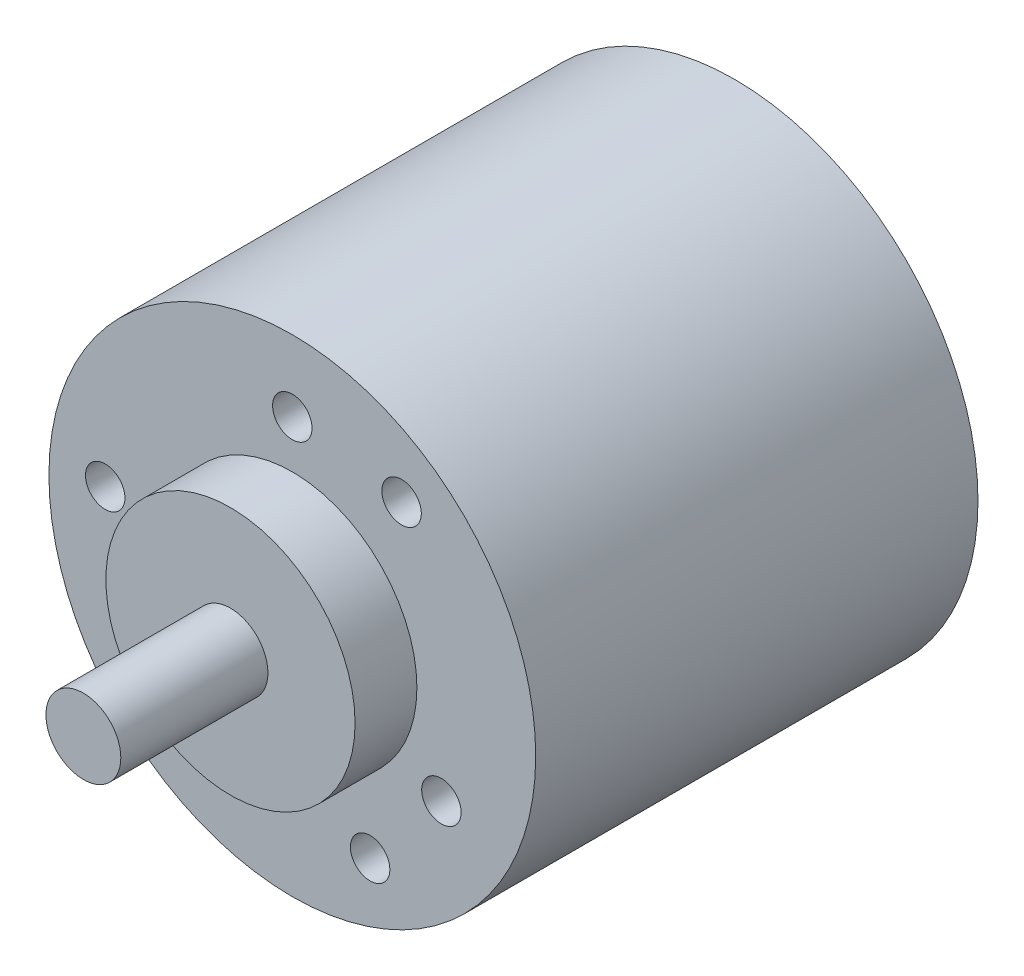
ISO-10303-21;
HEADER;
FILE_DESCRIPTION(('STEP AP214'),'2;1');
FILE_NAME('part.step','',(''),(''),'','','');
FILE_SCHEMA(('AUTOMOTIVE_DESIGN { 1 0 10303 214 1 1 1 1 }'));
ENDSEC;
DATA;
#1=APPLICATION_CONTEXT('core data for automotive mechanical design processes');
#2=APPLICATION_PROTOCOL_DEFINITION('international standard','automotive_design',2000,#1);
#3=PRODUCT_CONTEXT('',#1,'mechanical');
#4=PRODUCT('Part','Part','',(#3));
#5=PRODUCT_RELATED_PRODUCT_CATEGORY('part','',(#4));
#6=PRODUCT_DEFINITION_FORMATION('','',#4);
#7=PRODUCT_DEFINITION_CONTEXT('part definition',#1,'design');
#8=PRODUCT_DEFINITION('design','',#6,#7);
#9=PRODUCT_DEFINITION_SHAPE('','',#8);
#10=(LENGTH_UNIT() NAMED_UNIT(*) SI_UNIT(.MILLI.,.METRE.));
#11=(NAMED_UNIT(*) PLANE_ANGLE_UNIT() SI_UNIT($,.RADIAN.));
#12=(NAMED_UNIT(*) SI_UNIT($,.STERADIAN.) SOLID_ANGLE_UNIT());
#13=UNCERTAINTY_MEASURE_WITH_UNIT(LENGTH_MEASURE(1.E-05),#10,'distance_accuracy_value','');
#14=(GEOMETRIC_REPRESENTATION_CONTEXT(3) GLOBAL_UNCERTAINTY_ASSIGNED_CONTEXT((#13)) GLOBAL_UNIT_ASSIGNED_CONTEXT((#10,
#11,#12)) REPRESENTATION_CONTEXT('',''));
#15=CARTESIAN_POINT('',(0.,0.,0.));
#16=DIRECTION('',(0.,0.,1.));
#17=DIRECTION('',(1.,0.,0.));
#18=AXIS2_PLACEMENT_3D('',#15,#16,#17);
#19=CARTESIAN_POINT('',(0.,0.,-35.433));
#20=DIRECTION('',(0.,0.,1.));
#21=DIRECTION('',(1.,0.,0.));
#22=AXIS2_PLACEMENT_3D('',#19,#20,#21);
#23=CYLINDRICAL_SURFACE('',#22,19.5);
#24=CARTESIAN_POINT('',(0.,0.,-35.433));
#25=DIRECTION('',(0.,0.,1.));
#26=DIRECTION('',(1.,0.,0.));
#27=AXIS2_PLACEMENT_3D('',#24,#25,#26);
#28=CIRCLE('',#27,19.5);
#29=CARTESIAN_POINT('',(19.5,0.,-35.433));
#30=VERTEX_POINT('',#29);
#31=EDGE_CURVE('E10',#30,#30,#28,.T.);
#32=ORIENTED_EDGE('',*,*,#31,.T.);
#33=EDGE_LOOP('',(#32));
#34=FACE_BOUND('',#33,.T.);
#35=CARTESIAN_POINT('',(0.,0.,0.));
#36=DIRECTION('',(0.,0.,1.));
#37=DIRECTION('',(1.,0.,0.));
#38=AXIS2_PLACEMENT_3D('',#35,#36,#37);
#39=CIRCLE('',#38,19.5);
#40=CARTESIAN_POINT('',(19.5,0.,0.));
#41=VERTEX_POINT('',#40);
#42=EDGE_CURVE('E35',#41,#41,#39,.T.);
#43=ORIENTED_EDGE('',*,*,#42,.F.);
#44=EDGE_LOOP('',(#43));
#45=FACE_BOUND('',#44,.T.);
#46=ADVANCED_FACE('F32',(#34,#45),#23,.T.);
#47=CARTESIAN_POINT('',(0.,0.,-35.433));
#48=DIRECTION('',(0.,0.,1.));
#49=DIRECTION('',(1.,0.,0.));
#50=AXIS2_PLACEMENT_3D('',#47,#48,#49);
#51=PLANE('',#50);
#52=ORIENTED_EDGE('',*,*,#31,.F.);
#53=EDGE_LOOP('',(#52));
#54=FACE_BOUND('',#53,.T.);
#55=ADVANCED_FACE('F105',(#54),#51,.F.);
#56=CARTESIAN_POINT('',(0.,0.,0.));
#57=DIRECTION('',(0.,0.,1.));
#58=DIRECTION('',(1.,0.,0.));
#59=AXIS2_PLACEMENT_3D('',#56,#57,#58);
#60=PLANE('',#59);
#61=CARTESIAN_POINT('',(-14.989438745228,1.45613395779948,0.));
#62=DIRECTION('',(0.,0.,1.));
#63=DIRECTION('',(1.,0.,0.));
#64=AXIS2_PLACEMENT_3D('',#61,#62,#63);
#65=CIRCLE('',#64,1.58);
#66=CARTESIAN_POINT('',(-13.409438745228,1.45613395779948,0.));
#67=VERTEX_POINT('',#66);
#68=EDGE_CURVE('E86',#67,#67,#65,.T.);
#69=ORIENTED_EDGE('',*,*,#68,.F.);
#70=EDGE_LOOP('',(#69));
#71=FACE_BOUND('',#70,.T.);
#72=CARTESIAN_POINT('',(6.23367037384649,-13.709301720738,0.));
#73=DIRECTION('',(0.,0.,1.));
#74=DIRECTION('',(1.,0.,0.));
#75=AXIS2_PLACEMENT_3D('',#72,#73,#74);
#76=CIRCLE('',#75,1.58);
#77=CARTESIAN_POINT('',(7.81367037384649,-13.709301720738,0.));
#78=VERTEX_POINT('',#77);
#79=EDGE_CURVE('E80',#78,#78,#76,.T.);
#80=ORIENTED_EDGE('',*,*,#79,.F.);
#81=EDGE_LOOP('',(#80));
#82=FACE_BOUND('',#81,.T.);
#83=CARTESIAN_POINT('',(8.75576837138154,12.2531677629385,0.));
#84=DIRECTION('',(0.,0.,1.));
#85=DIRECTION('',(1.,0.,0.));
#86=AXIS2_PLACEMENT_3D('',#83,#84,#85);
#87=CIRCLE('',#86,1.58);
#88=CARTESIAN_POINT('',(10.3357683713815,12.2531677629385,0.));
#89=VERTEX_POINT('',#88);
#90=EDGE_CURVE('E74',#89,#89,#87,.T.);
#91=ORIENTED_EDGE('',*,*,#90,.F.);
#92=EDGE_LOOP('',(#91));
#93=FACE_BOUND('',#92,.T.);
#94=CARTESIAN_POINT('',(11.9443955740758,-6.89609999999989,0.));
#95=DIRECTION('',(0.,0.,1.));
#96=DIRECTION('',(1.,0.,0.));
#97=AXIS2_PLACEMENT_3D('',#94,#95,#96);
#98=CIRCLE('',#97,1.58);
#99=CARTESIAN_POINT('',(13.5243955740758,-6.89609999999989,0.));
#100=VERTEX_POINT('',#99);
#101=EDGE_CURVE('E68',#100,#100,#98,.T.);
#102=ORIENTED_EDGE('',*,*,#101,.F.);
#103=EDGE_LOOP('',(#102));
#104=FACE_BOUND('',#103,.T.);
#105=CARTESIAN_POINT('',(-11.9443955740757,-6.89610000000006,0.));
#106=DIRECTION('',(0.,0.,1.));
#107=DIRECTION('',(1.,0.,0.));
#108=AXIS2_PLACEMENT_3D('',#105,#106,#107);
#109=CIRCLE('',#108,1.58);
#110=CARTESIAN_POINT('',(-10.3643955740757,-6.89610000000006,0.));
#111=VERTEX_POINT('',#110);
#112=EDGE_CURVE('E62',#111,#111,#109,.T.);
#113=ORIENTED_EDGE('',*,*,#112,.F.);
#114=EDGE_LOOP('',(#113));
#115=FACE_BOUND('',#114,.T.);
#116=CARTESIAN_POINT('',(0.,13.7922,0.));
#117=DIRECTION('',(0.,0.,1.));
#118=DIRECTION('',(1.,0.,0.));
#119=AXIS2_PLACEMENT_3D('',#116,#117,#118);
#120=CIRCLE('',#119,1.58);
#121=CARTESIAN_POINT('',(1.58,13.7922,0.));
#122=VERTEX_POINT('',#121);
#123=EDGE_CURVE('E56',#122,#122,#120,.T.);
#124=ORIENTED_EDGE('',*,*,#123,.F.);
#125=EDGE_LOOP('',(#124));
#126=FACE_BOUND('',#125,.T.);
#127=CARTESIAN_POINT('',(0.,0.,0.));
#128=DIRECTION('',(0.,0.,1.));
#129=DIRECTION('',(1.,0.,0.));
#130=AXIS2_PLACEMENT_3D('',#127,#128,#129);
#131=CIRCLE('',#130,9.9822);
#132=CARTESIAN_POINT('',(9.9822,0.,0.));
#133=VERTEX_POINT('',#132);
#134=EDGE_CURVE('E44',#133,#133,#131,.T.);
#135=ORIENTED_EDGE('',*,*,#134,.F.);
#136=EDGE_LOOP('',(#135));
#137=FACE_BOUND('',#136,.T.);
#138=ORIENTED_EDGE('',*,*,#42,.T.);
#139=EDGE_LOOP('',(#138));
#140=FACE_BOUND('',#139,.T.);
#141=ADVANCED_FACE('F101',(#71,#82,#93,#104,#115,#126,#137,#140),#60,.T.);
#142=CARTESIAN_POINT('',(0.,0.,4.953));
#143=DIRECTION('',(0.,0.,-1.));
#144=DIRECTION('',(-1.,0.,0.));
#145=AXIS2_PLACEMENT_3D('',#142,#143,#144);
#146=CYLINDRICAL_SURFACE('',#145,9.9822);
#147=CARTESIAN_POINT('',(0.,0.,4.953));
#148=DIRECTION('',(0.,0.,1.));
#149=DIRECTION('',(1.,0.,0.));
#150=AXIS2_PLACEMENT_3D('',#147,#148,#149);
#151=CIRCLE('',#150,9.9822);
#152=CARTESIAN_POINT('',(9.9822,0.,4.953));
#153=VERTEX_POINT('',#152);
#154=EDGE_CURVE('E42',#153,#153,#151,.T.);
#155=ORIENTED_EDGE('',*,*,#154,.F.);
#156=EDGE_LOOP('',(#155));
#157=FACE_BOUND('',#156,.T.);
#158=ORIENTED_EDGE('',*,*,#134,.T.);
#159=EDGE_LOOP('',(#158));
#160=FACE_BOUND('',#159,.T.);
#161=ADVANCED_FACE('F104',(#157,#160),#146,.T.);
#162=CARTESIAN_POINT('',(0.,0.,4.953));
#163=DIRECTION('',(0.,0.,1.));
#164=DIRECTION('',(1.,0.,0.));
#165=AXIS2_PLACEMENT_3D('',#162,#163,#164);
#166=PLANE('',#165);
#167=CARTESIAN_POINT('',(0.,0.,4.953));
#168=DIRECTION('',(0.,0.,1.));
#169=DIRECTION('',(1.,0.,0.));
#170=AXIS2_PLACEMENT_3D('',#167,#168,#169);
#171=CIRCLE('',#170,3.);
#172=CARTESIAN_POINT('',(3.,0.,4.953));
#173=VERTEX_POINT('',#172);
#174=EDGE_CURVE('E50',#173,#173,#171,.T.);
#175=ORIENTED_EDGE('',*,*,#174,.F.);
#176=EDGE_LOOP('',(#175));
#177=FACE_BOUND('',#176,.T.);
#178=ORIENTED_EDGE('',*,*,#154,.T.);
#179=EDGE_LOOP('',(#178));
#180=FACE_BOUND('',#179,.T.);
#181=ADVANCED_FACE('F131',(#177,#180),#166,.T.);
#182=CARTESIAN_POINT('',(0.,0.,16.7386));
#183=DIRECTION('',(0.,0.,-1.));
#184=DIRECTION('',(-1.,0.,0.));
#185=AXIS2_PLACEMENT_3D('',#182,#183,#184);
#186=CYLINDRICAL_SURFACE('',#185,3.);
#187=CARTESIAN_POINT('',(0.,0.,16.7386));
#188=DIRECTION('',(0.,0.,1.));
#189=DIRECTION('',(1.,0.,0.));
#190=AXIS2_PLACEMENT_3D('',#187,#188,#189);
#191=CIRCLE('',#190,3.);
#192=CARTESIAN_POINT('',(3.,0.,16.7386));
#193=VERTEX_POINT('',#192);
#194=EDGE_CURVE('E47',#193,#193,#191,.T.);
#195=ORIENTED_EDGE('',*,*,#194,.F.);
#196=EDGE_LOOP('',(#195));
#197=FACE_BOUND('',#196,.T.);
#198=ORIENTED_EDGE('',*,*,#174,.T.);
#199=EDGE_LOOP('',(#198));
#200=FACE_BOUND('',#199,.T.);
#201=ADVANCED_FACE('F135',(#197,#200),#186,.T.);
#202=CARTESIAN_POINT('',(0.,0.,16.7386));
#203=DIRECTION('',(0.,0.,1.));
#204=DIRECTION('',(1.,0.,0.));
#205=AXIS2_PLACEMENT_3D('',#202,#203,#204);
#206=PLANE('',#205);
#207=ORIENTED_EDGE('',*,*,#194,.T.);
#208=EDGE_LOOP('',(#207));
#209=FACE_BOUND('',#208,.T.);
#210=ADVANCED_FACE('F139',(#209),#206,.T.);
#211=CARTESIAN_POINT('',(0.,13.7922,-5.08));
#212=DIRECTION('',(0.,0.,1.));
#213=DIRECTION('',(1.,0.,0.));
#214=AXIS2_PLACEMENT_3D('',#211,#212,#213);
#215=CYLINDRICAL_SURFACE('',#214,1.58);
#216=CARTESIAN_POINT('',(0.,13.7922,-5.08));
#217=DIRECTION('',(0.,0.,1.));
#218=DIRECTION('',(1.,0.,0.));
#219=AXIS2_PLACEMENT_3D('',#216,#217,#218);
#220=CIRCLE('',#219,1.58);
#221=CARTESIAN_POINT('',(1.58,13.7922,-5.08));
#222=VERTEX_POINT('',#221);
#223=EDGE_CURVE('E53',#222,#222,#220,.T.);
#224=ORIENTED_EDGE('',*,*,#223,.F.);
#225=EDGE_LOOP('',(#224));
#226=FACE_BOUND('',#225,.T.);
#227=ORIENTED_EDGE('',*,*,#123,.T.);
#228=EDGE_LOOP('',(#227));
#229=FACE_BOUND('',#228,.T.);
#230=ADVANCED_FACE('F143',(#226,#229),#215,.F.);
#231=CARTESIAN_POINT('',(0.,13.7922,-5.08));
#232=DIRECTION('',(0.,0.,1.));
#233=DIRECTION('',(1.,0.,0.));
#234=AXIS2_PLACEMENT_3D('',#231,#232,#233);
#235=PLANE('',#234);
#236=ORIENTED_EDGE('',*,*,#223,.T.);
#237=EDGE_LOOP('',(#236));
#238=FACE_BOUND('',#237,.T.);
#239=ADVANCED_FACE('F147',(#238),#235,.T.);
#240=CARTESIAN_POINT('',(-11.9443955740757,-6.89610000000006,-5.08));
#241=DIRECTION('',(0.,0.,1.));
#242=DIRECTION('',(1.,0.,0.));
#243=AXIS2_PLACEMENT_3D('',#240,#241,#242);
#244=CYLINDRICAL_SURFACE('',#243,1.58);
#245=CARTESIAN_POINT('',(-11.9443955740757,-6.89610000000006,-5.08));
#246=DIRECTION('',(0.,0.,1.));
#247=DIRECTION('',(1.,0.,0.));
#248=AXIS2_PLACEMENT_3D('',#245,#246,#247);
#249=CIRCLE('',#248,1.58);
#250=CARTESIAN_POINT('',(-10.3643955740757,-6.89610000000006,-5.08));
#251=VERTEX_POINT('',#250);
#252=EDGE_CURVE('E59',#251,#251,#249,.T.);
#253=ORIENTED_EDGE('',*,*,#252,.F.);
#254=EDGE_LOOP('',(#253));
#255=FACE_BOUND('',#254,.T.);
#256=ORIENTED_EDGE('',*,*,#112,.T.);
#257=EDGE_LOOP('',(#256));
#258=FACE_BOUND('',#257,.T.);
#259=ADVANCED_FACE('F151',(#255,#258),#244,.F.);
#260=CARTESIAN_POINT('',(-11.9443955740757,-6.89610000000006,-5.08));
#261=DIRECTION('',(0.,0.,1.));
#262=DIRECTION('',(1.,0.,0.));
#263=AXIS2_PLACEMENT_3D('',#260,#261,#262);
#264=PLANE('',#263);
#265=ORIENTED_EDGE('',*,*,#252,.T.);
#266=EDGE_LOOP('',(#265));
#267=FACE_BOUND('',#266,.T.);
#268=ADVANCED_FACE('F155',(#267),#264,.T.);
#269=CARTESIAN_POINT('',(11.9443955740758,-6.89609999999989,-5.08));
#270=DIRECTION('',(0.,0.,1.));
#271=DIRECTION('',(1.,0.,0.));
#272=AXIS2_PLACEMENT_3D('',#269,#270,#271);
#273=CYLINDRICAL_SURFACE('',#272,1.58);
#274=CARTESIAN_POINT('',(11.9443955740758,-6.89609999999989,-5.08));
#275=DIRECTION('',(0.,0.,1.));
#276=DIRECTION('',(1.,0.,0.));
#277=AXIS2_PLACEMENT_3D('',#274,#275,#276);
#278=CIRCLE('',#277,1.58);
#279=CARTESIAN_POINT('',(13.5243955740758,-6.89609999999989,-5.08));
#280=VERTEX_POINT('',#279);
#281=EDGE_CURVE('E65',#280,#280,#278,.T.);
#282=ORIENTED_EDGE('',*,*,#281,.F.);
#283=EDGE_LOOP('',(#282));
#284=FACE_BOUND('',#283,.T.);
#285=ORIENTED_EDGE('',*,*,#101,.T.);
#286=EDGE_LOOP('',(#285));
#287=FACE_BOUND('',#286,.T.);
#288=ADVANCED_FACE('F159',(#284,#287),#273,.F.);
#289=CARTESIAN_POINT('',(11.9443955740758,-6.89609999999989,-5.08));
#290=DIRECTION('',(0.,0.,1.));
#291=DIRECTION('',(1.,0.,0.));
#292=AXIS2_PLACEMENT_3D('',#289,#290,#291);
#293=PLANE('',#292);
#294=ORIENTED_EDGE('',*,*,#281,.T.);
#295=EDGE_LOOP('',(#294));
#296=FACE_BOUND('',#295,.T.);
#297=ADVANCED_FACE('F163',(#296),#293,.T.);
#298=CARTESIAN_POINT('',(8.75576837138154,12.2531677629385,-5.08));
#299=DIRECTION('',(0.,0.,1.));
#300=DIRECTION('',(1.,0.,0.));
#301=AXIS2_PLACEMENT_3D('',#298,#299,#300);
#302=CYLINDRICAL_SURFACE('',#301,1.58);
#303=CARTESIAN_POINT('',(8.75576837138154,12.2531677629385,-5.08));
#304=DIRECTION('',(0.,0.,1.));
#305=DIRECTION('',(1.,0.,0.));
#306=AXIS2_PLACEMENT_3D('',#303,#304,#305);
#307=CIRCLE('',#306,1.58);
#308=CARTESIAN_POINT('',(10.3357683713815,12.2531677629385,-5.08));
#309=VERTEX_POINT('',#308);
#310=EDGE_CURVE('E71',#309,#309,#307,.T.);
#311=ORIENTED_EDGE('',*,*,#310,.F.);
#312=EDGE_LOOP('',(#311));
#313=FACE_BOUND('',#312,.T.);
#314=ORIENTED_EDGE('',*,*,#90,.T.);
#315=EDGE_LOOP('',(#314));
#316=FACE_BOUND('',#315,.T.);
#317=ADVANCED_FACE('F167',(#313,#316),#302,.F.);
#318=CARTESIAN_POINT('',(8.75576837138154,12.2531677629385,-5.08));
#319=DIRECTION('',(0.,0.,1.));
#320=DIRECTION('',(1.,0.,0.));
#321=AXIS2_PLACEMENT_3D('',#318,#319,#320);
#322=PLANE('',#321);
#323=ORIENTED_EDGE('',*,*,#310,.T.);
#324=EDGE_LOOP('',(#323));
#325=FACE_BOUND('',#324,.T.);
#326=ADVANCED_FACE('F171',(#325),#322,.T.);
#327=CARTESIAN_POINT('',(6.23367037384649,-13.709301720738,-5.08));
#328=DIRECTION('',(0.,0.,1.));
#329=DIRECTION('',(1.,0.,0.));
#330=AXIS2_PLACEMENT_3D('',#327,#328,#329);
#331=CYLINDRICAL_SURFACE('',#330,1.58);
#332=CARTESIAN_POINT('',(6.23367037384649,-13.709301720738,-5.08));
#333=DIRECTION('',(0.,0.,1.));
#334=DIRECTION('',(1.,0.,0.));
#335=AXIS2_PLACEMENT_3D('',#332,#333,#334);
#336=CIRCLE('',#335,1.58);
#337=CARTESIAN_POINT('',(7.81367037384649,-13.709301720738,-5.08));
#338=VERTEX_POINT('',#337);
#339=EDGE_CURVE('E77',#338,#338,#336,.T.);
#340=ORIENTED_EDGE('',*,*,#339,.F.);
#341=EDGE_LOOP('',(#340));
#342=FACE_BOUND('',#341,.T.);
#343=ORIENTED_EDGE('',*,*,#79,.T.);
#344=EDGE_LOOP('',(#343));
#345=FACE_BOUND('',#344,.T.);
#346=ADVANCED_FACE('F175',(#342,#345),#331,.F.);
#347=CARTESIAN_POINT('',(6.23367037384649,-13.709301720738,-5.08));
#348=DIRECTION('',(0.,0.,1.));
#349=DIRECTION('',(1.,0.,0.));
#350=AXIS2_PLACEMENT_3D('',#347,#348,#349);
#351=PLANE('',#350);
#352=ORIENTED_EDGE('',*,*,#339,.T.);
#353=EDGE_LOOP('',(#352));
#354=FACE_BOUND('',#353,.T.);
#355=ADVANCED_FACE('F97',(#354),#351,.T.);
#356=CARTESIAN_POINT('',(-14.989438745228,1.45613395779948,-5.08));
#357=DIRECTION('',(0.,0.,1.));
#358=DIRECTION('',(1.,0.,0.));
#359=AXIS2_PLACEMENT_3D('',#356,#357,#358);
#360=CYLINDRICAL_SURFACE('',#359,1.58);
#361=CARTESIAN_POINT('',(-14.989438745228,1.45613395779948,-5.08));
#362=DIRECTION('',(0.,0.,1.));
#363=DIRECTION('',(1.,0.,0.));
#364=AXIS2_PLACEMENT_3D('',#361,#362,#363);
#365=CIRCLE('',#364,1.58);
#366=CARTESIAN_POINT('',(-13.409438745228,1.45613395779948,-5.08));
#367=VERTEX_POINT('',#366);
#368=EDGE_CURVE('E83',#367,#367,#365,.T.);
#369=ORIENTED_EDGE('',*,*,#368,.F.);
#370=EDGE_LOOP('',(#369));
#371=FACE_BOUND('',#370,.T.);
#372=ORIENTED_EDGE('',*,*,#68,.T.);
#373=EDGE_LOOP('',(#372));
#374=FACE_BOUND('',#373,.T.);
#375=ADVANCED_FACE('F94',(#371,#374),#360,.F.);
#376=CARTESIAN_POINT('',(-14.989438745228,1.45613395779948,-5.08));
#377=DIRECTION('',(0.,0.,1.));
#378=DIRECTION('',(1.,0.,0.));
#379=AXIS2_PLACEMENT_3D('',#376,#377,#378);
#380=PLANE('',#379);
#381=ORIENTED_EDGE('',*,*,#368,.T.);
#382=EDGE_LOOP('',(#381));
#383=FACE_BOUND('',#382,.T.);
#384=ADVANCED_FACE('F92',(#383),#380,.T.);
#385=CLOSED_SHELL('',(#46,#55,#141,#161,#181,#201,#210,#230,#239,#259,#268,#288,#297,#317,#326,
#346,#355,#375,#384));
#386=MANIFOLD_SOLID_BREP('B2',#385);
#387=ADVANCED_BREP_SHAPE_REPRESENTATION('',(#18,#386),#14);
#388=SHAPE_DEFINITION_REPRESENTATION(#9,#387);
ENDSEC;
END-ISO-10303-21;
